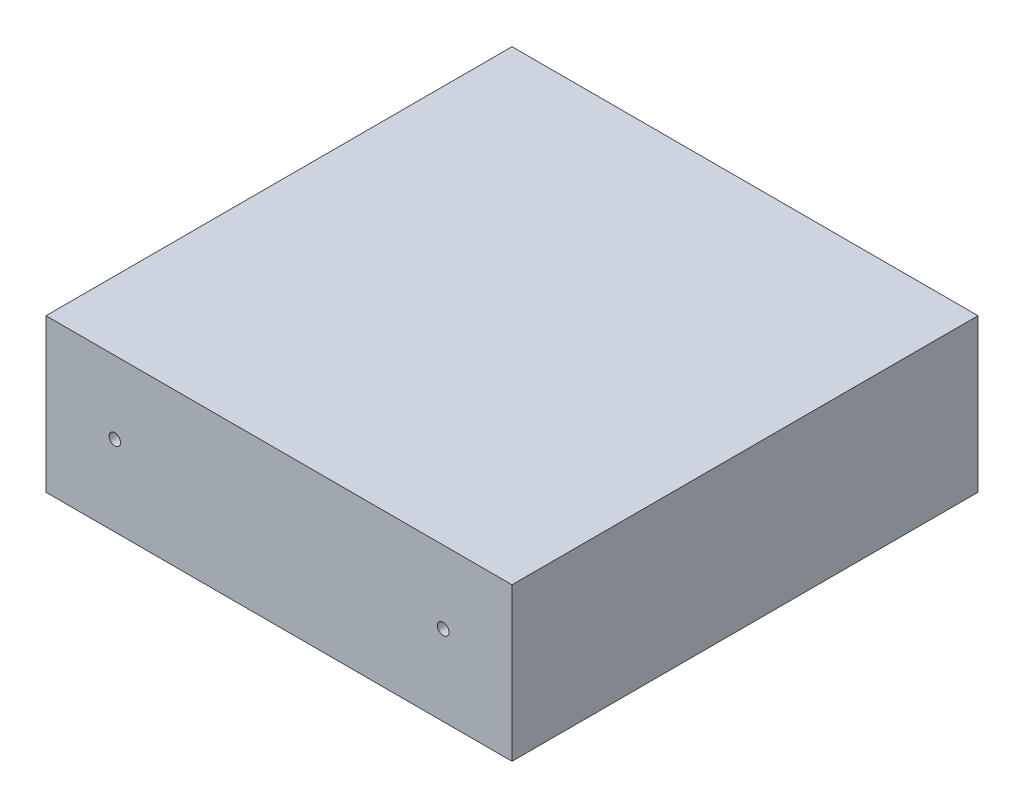
ISO-10303-21;
HEADER;
FILE_DESCRIPTION(('STEP AP214'),'2;1');
FILE_NAME('part.step','',(''),(''),'','','');
FILE_SCHEMA(('AUTOMOTIVE_DESIGN { 1 0 10303 214 1 1 1 1 }'));
ENDSEC;
DATA;
#1=APPLICATION_CONTEXT('core data for automotive mechanical design processes');
#2=APPLICATION_PROTOCOL_DEFINITION('international standard','automotive_design',2000,#1);
#3=PRODUCT_CONTEXT('',#1,'mechanical');
#4=PRODUCT('Part','Part','',(#3));
#5=PRODUCT_RELATED_PRODUCT_CATEGORY('part','',(#4));
#6=PRODUCT_DEFINITION_FORMATION('','',#4);
#7=PRODUCT_DEFINITION_CONTEXT('part definition',#1,'design');
#8=PRODUCT_DEFINITION('design','',#6,#7);
#9=PRODUCT_DEFINITION_SHAPE('','',#8);
#10=(LENGTH_UNIT() NAMED_UNIT(*) SI_UNIT(.MILLI.,.METRE.));
#11=(NAMED_UNIT(*) PLANE_ANGLE_UNIT() SI_UNIT($,.RADIAN.));
#12=(NAMED_UNIT(*) SI_UNIT($,.STERADIAN.) SOLID_ANGLE_UNIT());
#13=UNCERTAINTY_MEASURE_WITH_UNIT(LENGTH_MEASURE(1.E-05),#10,'distance_accuracy_value','');
#14=(GEOMETRIC_REPRESENTATION_CONTEXT(3) GLOBAL_UNCERTAINTY_ASSIGNED_CONTEXT((#13)) GLOBAL_UNIT_ASSIGNED_CONTEXT((#10,
#11,#12)) REPRESENTATION_CONTEXT('',''));
#15=CARTESIAN_POINT('',(0.,0.,0.));
#16=DIRECTION('',(0.,0.,1.));
#17=DIRECTION('',(1.,0.,0.));
#18=AXIS2_PLACEMENT_3D('',#15,#16,#17);
#19=CARTESIAN_POINT('',(0.,133.35,0.));
#20=DIRECTION('',(1.,0.,0.));
#21=DIRECTION('',(0.,0.,-1.));
#22=AXIS2_PLACEMENT_3D('',#19,#20,#21);
#23=PLANE('',#22);
#24=DIRECTION('',(0.,0.,1.));
#25=VECTOR('',#24,1.);
#26=CARTESIAN_POINT('',(0.,0.,0.));
#27=LINE('',#26,#25);
#28=CARTESIAN_POINT('',(0.,0.,-406.4));
#29=VERTEX_POINT('',#28);
#30=CARTESIAN_POINT('',(0.,0.,0.));
#31=VERTEX_POINT('',#30);
#32=EDGE_CURVE('E96',#29,#31,#27,.T.);
#33=ORIENTED_EDGE('',*,*,#32,.T.);
#34=DIRECTION('',(0.,-1.,0.));
#35=VECTOR('',#34,1.);
#36=CARTESIAN_POINT('',(0.,133.35,0.));
#37=LINE('',#36,#35);
#38=CARTESIAN_POINT('',(0.,133.35,0.));
#39=VERTEX_POINT('',#38);
#40=EDGE_CURVE('E11',#39,#31,#37,.T.);
#41=ORIENTED_EDGE('',*,*,#40,.F.);
#42=DIRECTION('',(0.,0.,1.));
#43=VECTOR('',#42,1.);
#44=CARTESIAN_POINT('',(0.,133.35,0.));
#45=LINE('',#44,#43);
#46=CARTESIAN_POINT('',(0.,133.35,-406.4));
#47=VERTEX_POINT('',#46);
#48=EDGE_CURVE('E84',#47,#39,#45,.T.);
#49=ORIENTED_EDGE('',*,*,#48,.F.);
#50=DIRECTION('',(0.,-1.,0.));
#51=VECTOR('',#50,1.);
#52=CARTESIAN_POINT('',(0.,133.35,-406.4));
#53=LINE('',#52,#51);
#54=EDGE_CURVE('E92',#47,#29,#53,.T.);
#55=ORIENTED_EDGE('',*,*,#54,.T.);
#56=EDGE_LOOP('',(#33,#41,#49,#55));
#57=FACE_BOUND('',#56,.T.);
#58=ADVANCED_FACE('F33',(#57),#23,.F.);
#59=CARTESIAN_POINT('',(0.,133.35,0.));
#60=DIRECTION('',(0.,0.,-1.));
#61=DIRECTION('',(-1.,0.,0.));
#62=AXIS2_PLACEMENT_3D('',#59,#60,#61);
#63=PLANE('',#62);
#64=CARTESIAN_POINT('',(346.4,70.,0.));
#65=DIRECTION('',(0.,0.,1.));
#66=DIRECTION('',(1.,0.,0.));
#67=AXIS2_PLACEMENT_3D('',#64,#65,#66);
#68=CIRCLE('',#67,4.99999999999999);
#69=CARTESIAN_POINT('',(351.4,70.,0.));
#70=VERTEX_POINT('',#69);
#71=EDGE_CURVE('E116',#70,#70,#68,.T.);
#72=ORIENTED_EDGE('',*,*,#71,.F.);
#73=EDGE_LOOP('',(#72));
#74=FACE_BOUND('',#73,.T.);
#75=CARTESIAN_POINT('',(60.,70.,0.));
#76=DIRECTION('',(0.,0.,1.));
#77=DIRECTION('',(1.,0.,0.));
#78=AXIS2_PLACEMENT_3D('',#75,#76,#77);
#79=CIRCLE('',#78,5.00000000000002);
#80=CARTESIAN_POINT('',(65.,70.,0.));
#81=VERTEX_POINT('',#80);
#82=EDGE_CURVE('E110',#81,#81,#79,.T.);
#83=ORIENTED_EDGE('',*,*,#82,.F.);
#84=EDGE_LOOP('',(#83));
#85=FACE_BOUND('',#84,.T.);
#86=DIRECTION('',(1.,0.,0.));
#87=VECTOR('',#86,1.);
#88=CARTESIAN_POINT('',(0.,0.,0.));
#89=LINE('',#88,#87);
#90=CARTESIAN_POINT('',(406.4,0.,0.));
#91=VERTEX_POINT('',#90);
#92=EDGE_CURVE('E88',#31,#91,#89,.T.);
#93=ORIENTED_EDGE('',*,*,#92,.T.);
#94=DIRECTION('',(0.,-1.,0.));
#95=VECTOR('',#94,1.);
#96=CARTESIAN_POINT('',(406.4,133.35,0.));
#97=LINE('',#96,#95);
#98=CARTESIAN_POINT('',(406.4,133.35,0.));
#99=VERTEX_POINT('',#98);
#100=EDGE_CURVE('E41',#99,#91,#97,.T.);
#101=ORIENTED_EDGE('',*,*,#100,.F.);
#102=DIRECTION('',(1.,0.,0.));
#103=VECTOR('',#102,1.);
#104=CARTESIAN_POINT('',(0.,133.35,0.));
#105=LINE('',#104,#103);
#106=EDGE_CURVE('E79',#39,#99,#105,.T.);
#107=ORIENTED_EDGE('',*,*,#106,.F.);
#108=ORIENTED_EDGE('',*,*,#40,.T.);
#109=EDGE_LOOP('',(#93,#101,#107,#108));
#110=FACE_BOUND('',#109,.T.);
#111=ADVANCED_FACE('F87',(#74,#85,#110),#63,.F.);
#112=CARTESIAN_POINT('',(406.4,133.35,0.));
#113=DIRECTION('',(-1.,0.,0.));
#114=DIRECTION('',(0.,0.,1.));
#115=AXIS2_PLACEMENT_3D('',#112,#113,#114);
#116=PLANE('',#115);
#117=DIRECTION('',(0.,0.,-1.));
#118=VECTOR('',#117,1.);
#119=CARTESIAN_POINT('',(406.4,0.,0.));
#120=LINE('',#119,#118);
#121=CARTESIAN_POINT('',(406.4,0.,-406.4));
#122=VERTEX_POINT('',#121);
#123=EDGE_CURVE('E66',#91,#122,#120,.T.);
#124=ORIENTED_EDGE('',*,*,#123,.T.);
#125=DIRECTION('',(0.,-1.,0.));
#126=VECTOR('',#125,1.);
#127=CARTESIAN_POINT('',(406.4,133.35,-406.4));
#128=LINE('',#127,#126);
#129=CARTESIAN_POINT('',(406.4,133.35,-406.4));
#130=VERTEX_POINT('',#129);
#131=EDGE_CURVE('E89',#130,#122,#128,.T.);
#132=ORIENTED_EDGE('',*,*,#131,.F.);
#133=DIRECTION('',(0.,0.,-1.));
#134=VECTOR('',#133,1.);
#135=CARTESIAN_POINT('',(406.4,133.35,0.));
#136=LINE('',#135,#134);
#137=EDGE_CURVE('E82',#99,#130,#136,.T.);
#138=ORIENTED_EDGE('',*,*,#137,.F.);
#139=ORIENTED_EDGE('',*,*,#100,.T.);
#140=EDGE_LOOP('',(#124,#132,#138,#139));
#141=FACE_BOUND('',#140,.T.);
#142=ADVANCED_FACE('F90',(#141),#116,.F.);
#143=CARTESIAN_POINT('',(0.,133.35,-406.4));
#144=DIRECTION('',(0.,0.,1.));
#145=DIRECTION('',(1.,0.,0.));
#146=AXIS2_PLACEMENT_3D('',#143,#144,#145);
#147=PLANE('',#146);
#148=CARTESIAN_POINT('',(346.4,70.,-406.4));
#149=DIRECTION('',(0.,0.,1.));
#150=DIRECTION('',(1.,0.,0.));
#151=AXIS2_PLACEMENT_3D('',#148,#149,#150);
#152=CIRCLE('',#151,4.99999999999999);
#153=CARTESIAN_POINT('',(351.4,70.,-406.4));
#154=VERTEX_POINT('',#153);
#155=EDGE_CURVE('E113',#154,#154,#152,.T.);
#156=ORIENTED_EDGE('',*,*,#155,.T.);
#157=EDGE_LOOP('',(#156));
#158=FACE_BOUND('',#157,.T.);
#159=CARTESIAN_POINT('',(60.,70.,-406.4));
#160=DIRECTION('',(0.,0.,1.));
#161=DIRECTION('',(1.,0.,0.));
#162=AXIS2_PLACEMENT_3D('',#159,#160,#161);
#163=CIRCLE('',#162,5.00000000000002);
#164=CARTESIAN_POINT('',(65.,70.,-406.4));
#165=VERTEX_POINT('',#164);
#166=EDGE_CURVE('E99',#165,#165,#163,.T.);
#167=ORIENTED_EDGE('',*,*,#166,.T.);
#168=EDGE_LOOP('',(#167));
#169=FACE_BOUND('',#168,.T.);
#170=DIRECTION('',(-1.,0.,0.));
#171=VECTOR('',#170,1.);
#172=CARTESIAN_POINT('',(0.,0.,-406.4));
#173=LINE('',#172,#171);
#174=EDGE_CURVE('E72',#122,#29,#173,.T.);
#175=ORIENTED_EDGE('',*,*,#174,.T.);
#176=ORIENTED_EDGE('',*,*,#54,.F.);
#177=DIRECTION('',(-1.,0.,0.));
#178=VECTOR('',#177,1.);
#179=CARTESIAN_POINT('',(0.,133.35,-406.4));
#180=LINE('',#179,#178);
#181=EDGE_CURVE('E49',#130,#47,#180,.T.);
#182=ORIENTED_EDGE('',*,*,#181,.F.);
#183=ORIENTED_EDGE('',*,*,#131,.T.);
#184=EDGE_LOOP('',(#175,#176,#182,#183));
#185=FACE_BOUND('',#184,.T.);
#186=ADVANCED_FACE('F104',(#158,#169,#185),#147,.F.);
#187=CARTESIAN_POINT('',(0.,133.35,0.));
#188=DIRECTION('',(0.,-1.,0.));
#189=DIRECTION('',(0.,0.,-1.));
#190=AXIS2_PLACEMENT_3D('',#187,#188,#189);
#191=PLANE('',#190);
#192=ORIENTED_EDGE('',*,*,#48,.T.);
#193=ORIENTED_EDGE('',*,*,#106,.T.);
#194=ORIENTED_EDGE('',*,*,#137,.T.);
#195=ORIENTED_EDGE('',*,*,#181,.T.);
#196=EDGE_LOOP('',(#192,#193,#194,#195));
#197=FACE_BOUND('',#196,.T.);
#198=ADVANCED_FACE('F80',(#197),#191,.F.);
#199=CARTESIAN_POINT('',(0.,0.,0.));
#200=DIRECTION('',(0.,-1.,0.));
#201=DIRECTION('',(0.,0.,-1.));
#202=AXIS2_PLACEMENT_3D('',#199,#200,#201);
#203=PLANE('',#202);
#204=ORIENTED_EDGE('',*,*,#32,.F.);
#205=ORIENTED_EDGE('',*,*,#174,.F.);
#206=ORIENTED_EDGE('',*,*,#123,.F.);
#207=ORIENTED_EDGE('',*,*,#92,.F.);
#208=EDGE_LOOP('',(#204,#205,#206,#207));
#209=FACE_BOUND('',#208,.T.);
#210=ADVANCED_FACE('F107',(#209),#203,.T.);
#211=CARTESIAN_POINT('',(60.,70.,-406.4));
#212=DIRECTION('',(0.,0.,1.));
#213=DIRECTION('',(1.,0.,0.));
#214=AXIS2_PLACEMENT_3D('',#211,#212,#213);
#215=CYLINDRICAL_SURFACE('',#214,5.00000000000002);
#216=ORIENTED_EDGE('',*,*,#166,.F.);
#217=EDGE_LOOP('',(#216));
#218=FACE_BOUND('',#217,.T.);
#219=ORIENTED_EDGE('',*,*,#82,.T.);
#220=EDGE_LOOP('',(#219));
#221=FACE_BOUND('',#220,.T.);
#222=ADVANCED_FACE('F127',(#218,#221),#215,.F.);
#223=CARTESIAN_POINT('',(346.4,70.,-406.4));
#224=DIRECTION('',(0.,0.,1.));
#225=DIRECTION('',(1.,0.,0.));
#226=AXIS2_PLACEMENT_3D('',#223,#224,#225);
#227=CYLINDRICAL_SURFACE('',#226,4.99999999999999);
#228=ORIENTED_EDGE('',*,*,#155,.F.);
#229=EDGE_LOOP('',(#228));
#230=FACE_BOUND('',#229,.T.);
#231=ORIENTED_EDGE('',*,*,#71,.T.);
#232=EDGE_LOOP('',(#231));
#233=FACE_BOUND('',#232,.T.);
#234=ADVANCED_FACE('F124',(#230,#233),#227,.F.);
#235=CLOSED_SHELL('',(#58,#111,#142,#186,#198,#210,#222,#234));
#236=MANIFOLD_SOLID_BREP('B2',#235);
#237=ADVANCED_BREP_SHAPE_REPRESENTATION('',(#18,#236),#14);
#238=SHAPE_DEFINITION_REPRESENTATION(#9,#237);
ENDSEC;
END-ISO-10303-21;
